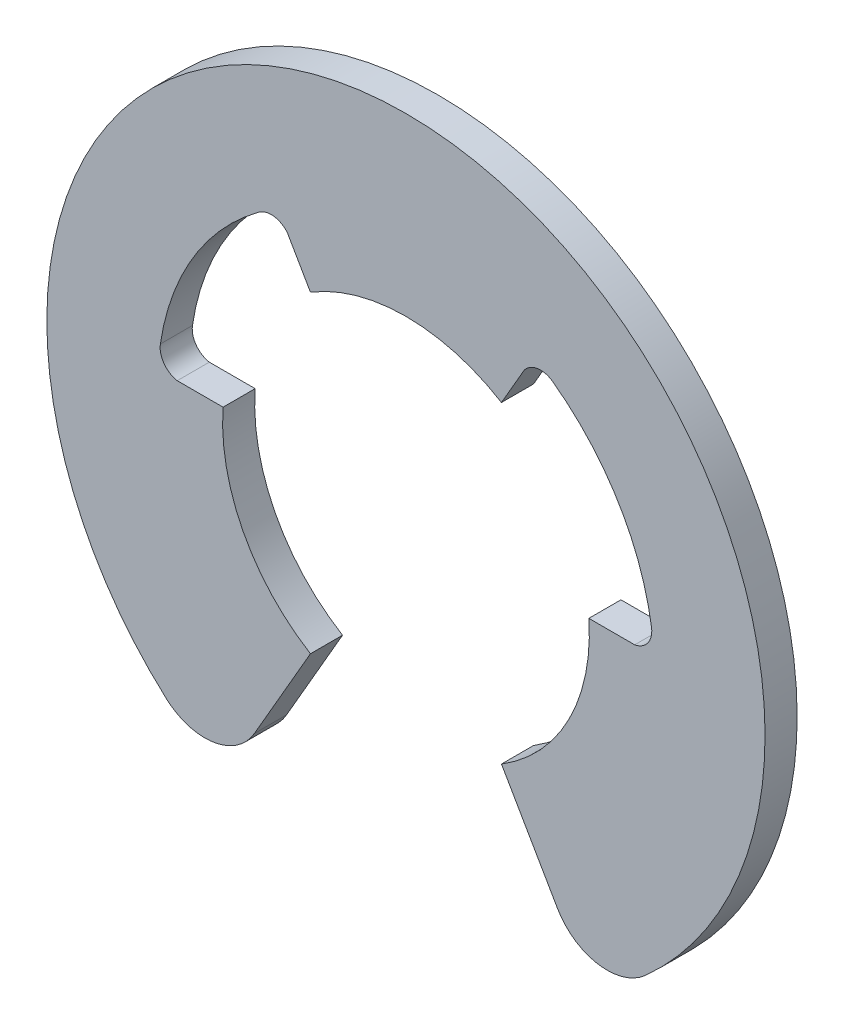
ISO-10303-21;
HEADER;
FILE_DESCRIPTION(('STEP AP214'),'2;1');
FILE_NAME('part.step','',(''),(''),'','','');
FILE_SCHEMA(('AUTOMOTIVE_DESIGN { 1 0 10303 214 1 1 1 1 }'));
ENDSEC;
DATA;
#1=APPLICATION_CONTEXT('core data for automotive mechanical design processes');
#2=APPLICATION_PROTOCOL_DEFINITION('international standard','automotive_design',2000,#1);
#3=PRODUCT_CONTEXT('',#1,'mechanical');
#4=PRODUCT('Part','Part','',(#3));
#5=PRODUCT_RELATED_PRODUCT_CATEGORY('part','',(#4));
#6=PRODUCT_DEFINITION_FORMATION('','',#4);
#7=PRODUCT_DEFINITION_CONTEXT('part definition',#1,'design');
#8=PRODUCT_DEFINITION('design','',#6,#7);
#9=PRODUCT_DEFINITION_SHAPE('','',#8);
#10=(LENGTH_UNIT() NAMED_UNIT(*) SI_UNIT(.MILLI.,.METRE.));
#11=(NAMED_UNIT(*) PLANE_ANGLE_UNIT() SI_UNIT($,.RADIAN.));
#12=(NAMED_UNIT(*) SI_UNIT($,.STERADIAN.) SOLID_ANGLE_UNIT());
#13=UNCERTAINTY_MEASURE_WITH_UNIT(LENGTH_MEASURE(1.E-05),#10,'distance_accuracy_value','');
#14=(GEOMETRIC_REPRESENTATION_CONTEXT(3) GLOBAL_UNCERTAINTY_ASSIGNED_CONTEXT((#13)) GLOBAL_UNIT_ASSIGNED_CONTEXT((#10,
#11,#12)) REPRESENTATION_CONTEXT('',''));
#15=CARTESIAN_POINT('',(0.,0.,0.));
#16=DIRECTION('',(0.,0.,1.));
#17=DIRECTION('',(1.,0.,0.));
#18=AXIS2_PLACEMENT_3D('',#15,#16,#17);
#19=CARTESIAN_POINT('',(0.,0.891268046824813,-0.5334));
#20=DIRECTION('',(0.,0.,1.));
#21=DIRECTION('',(1.,0.,0.));
#22=AXIS2_PLACEMENT_3D('',#19,#20,#21);
#23=PLANE('',#22);
#24=DIRECTION('',(0.5,0.866025403784439,0.));
#25=VECTOR('',#24,1.);
#26=CARTESIAN_POINT('',(3.937,6.52372423249865,-0.5334));
#27=LINE('',#26,#25);
#28=CARTESIAN_POINT('',(3.175,5.20390151713116,-0.5334));
#29=VERTEX_POINT('',#28);
#30=CARTESIAN_POINT('',(3.937,6.52372423249865,-0.5334));
#31=VERTEX_POINT('',#30);
#32=EDGE_CURVE('E150',#29,#31,#27,.T.);
#33=ORIENTED_EDGE('',*,*,#32,.F.);
#34=CARTESIAN_POINT('',(0.,0.,-0.5334));
#35=DIRECTION('',(0.,0.,-1.));
#36=DIRECTION('',(0.,-1.,0.));
#37=AXIS2_PLACEMENT_3D('',#34,#35,#36);
#38=CIRCLE('',#37,6.096);
#39=CARTESIAN_POINT('',(-3.175,5.20390151713116,-0.5334));
#40=VERTEX_POINT('',#39);
#41=EDGE_CURVE('E34',#40,#29,#38,.T.);
#42=ORIENTED_EDGE('',*,*,#41,.F.);
#43=DIRECTION('',(0.5,-0.866025403784439,0.));
#44=VECTOR('',#43,1.);
#45=CARTESIAN_POINT('',(-3.175,5.20390151713116,-0.5334));
#46=LINE('',#45,#44);
#47=CARTESIAN_POINT('',(-3.937,6.52372423249865,-0.5334));
#48=VERTEX_POINT('',#47);
#49=EDGE_CURVE('E164',#48,#40,#46,.T.);
#50=ORIENTED_EDGE('',*,*,#49,.F.);
#51=CARTESIAN_POINT('',(-4.47800833674543,6.10317047054672,-0.5334));
#52=DIRECTION('',(0.,0.,-1.));
#53=DIRECTION('',(0.,-1.,0.));
#54=AXIS2_PLACEMENT_3D('',#51,#52,#53);
#55=CIRCLE('',#54,0.68524118901302);
#56=CARTESIAN_POINT('',(-4.88337339971519,6.65565092526299,-0.5334));
#57=VERTEX_POINT('',#56);
#58=EDGE_CURVE('E168',#57,#48,#55,.T.);
#59=ORIENTED_EDGE('',*,*,#58,.F.);
#60=CARTESIAN_POINT('',(0.,0.,-0.5334));
#61=DIRECTION('',(0.,0.,-1.));
#62=DIRECTION('',(0.,-1.,0.));
#63=AXIS2_PLACEMENT_3D('',#60,#61,#62);
#64=CIRCLE('',#63,8.25500000000001);
#65=CARTESIAN_POINT('',(-8.16449435264891,1.21903936177794,-0.5334));
#66=VERTEX_POINT('',#65);
#67=EDGE_CURVE('E175',#66,#57,#64,.T.);
#68=ORIENTED_EDGE('',*,*,#67,.F.);
#69=CARTESIAN_POINT('',(-7.48676596768232,1.11784784370182,-0.5334));
#70=DIRECTION('',(0.,0.,-1.));
#71=DIRECTION('',(0.,-1.,0.));
#72=AXIS2_PLACEMENT_3D('',#69,#70,#71);
#73=CIRCLE('',#72,0.68524118901302);
#74=CARTESIAN_POINT('',(-7.60390451388889,0.44269301100595,-0.5334));
#75=VERTEX_POINT('',#74);
#76=EDGE_CURVE('E182',#75,#66,#73,.T.);
#77=ORIENTED_EDGE('',*,*,#76,.F.);
#78=DIRECTION('',(-1.,0.,0.));
#79=VECTOR('',#78,1.);
#80=CARTESIAN_POINT('',(-7.60390451388889,0.44269301100595,-0.5334));
#81=LINE('',#80,#79);
#82=CARTESIAN_POINT('',(-6.07990451388889,0.442693011005949,-0.5334));
#83=VERTEX_POINT('',#82);
#84=EDGE_CURVE('E189',#83,#75,#81,.T.);
#85=ORIENTED_EDGE('',*,*,#84,.F.);
#86=CARTESIAN_POINT('',(0.,0.,-0.5334));
#87=DIRECTION('',(0.,0.,-1.));
#88=DIRECTION('',(0.,-1.,0.));
#89=AXIS2_PLACEMENT_3D('',#86,#87,#88);
#90=CIRCLE('',#89,6.096);
#91=CARTESIAN_POINT('',(-3.175,-5.20390151713116,-0.5334));
#92=VERTEX_POINT('',#91);
#93=EDGE_CURVE('E196',#92,#83,#90,.T.);
#94=ORIENTED_EDGE('',*,*,#93,.F.);
#95=DIRECTION('',(0.5,0.866025403784438,0.));
#96=VECTOR('',#95,1.);
#97=CARTESIAN_POINT('',(-3.175,-5.20390151713116,-0.5334));
#98=LINE('',#97,#96);
#99=CARTESIAN_POINT('',(-5.03828134704732,-8.43119947901249,-0.5334));
#100=VERTEX_POINT('',#99);
#101=EDGE_CURVE('E203',#100,#92,#98,.T.);
#102=ORIENTED_EDGE('',*,*,#101,.F.);
#103=CARTESIAN_POINT('',(-6.68805974125667,-7.47869947901249,-0.5334));
#104=DIRECTION('',(0.,0.,1.));
#105=DIRECTION('',(1.,0.,0.));
#106=AXIS2_PLACEMENT_3D('',#103,#104,#105);
#107=CIRCLE('',#106,1.905);
#108=CARTESIAN_POINT('',(-7.95794450225478,-8.89870570920474,-0.5334));
#109=VERTEX_POINT('',#108);
#110=EDGE_CURVE('E210',#109,#100,#107,.T.);
#111=ORIENTED_EDGE('',*,*,#110,.F.);
#112=CARTESIAN_POINT('',(0.,0.,-0.5334));
#113=DIRECTION('',(0.,0.,1.));
#114=DIRECTION('',(1.,0.,0.));
#115=AXIS2_PLACEMENT_3D('',#112,#113,#114);
#116=CIRCLE('',#115,11.938);
#117=CARTESIAN_POINT('',(7.95794450225478,-8.89870570920474,-0.5334));
#118=VERTEX_POINT('',#117);
#119=EDGE_CURVE('E217',#118,#109,#116,.T.);
#120=ORIENTED_EDGE('',*,*,#119,.F.);
#121=CARTESIAN_POINT('',(6.68805974125667,-7.47869947901249,-0.5334));
#122=DIRECTION('',(0.,0.,1.));
#123=DIRECTION('',(1.,0.,0.));
#124=AXIS2_PLACEMENT_3D('',#121,#122,#123);
#125=CIRCLE('',#124,1.905);
#126=CARTESIAN_POINT('',(5.03828134704732,-8.43119947901249,-0.5334));
#127=VERTEX_POINT('',#126);
#128=EDGE_CURVE('E224',#127,#118,#125,.T.);
#129=ORIENTED_EDGE('',*,*,#128,.F.);
#130=DIRECTION('',(0.5,-0.866025403784439,0.));
#131=VECTOR('',#130,1.);
#132=CARTESIAN_POINT('',(5.03828134704732,-8.43119947901249,-0.5334));
#133=LINE('',#132,#131);
#134=CARTESIAN_POINT('',(3.175,-5.20390151713116,-0.5334));
#135=VERTEX_POINT('',#134);
#136=EDGE_CURVE('E231',#135,#127,#133,.T.);
#137=ORIENTED_EDGE('',*,*,#136,.F.);
#138=CARTESIAN_POINT('',(0.,0.,-0.5334));
#139=DIRECTION('',(0.,0.,-1.));
#140=DIRECTION('',(0.,-1.,0.));
#141=AXIS2_PLACEMENT_3D('',#138,#139,#140);
#142=CIRCLE('',#141,6.096);
#143=CARTESIAN_POINT('',(6.07990451388889,0.442693011005951,-0.5334));
#144=VERTEX_POINT('',#143);
#145=EDGE_CURVE('E238',#144,#135,#142,.T.);
#146=ORIENTED_EDGE('',*,*,#145,.F.);
#147=DIRECTION('',(-1.,0.,0.));
#148=VECTOR('',#147,1.);
#149=CARTESIAN_POINT('',(6.07990451388889,0.442693011005951,-0.5334));
#150=LINE('',#149,#148);
#151=CARTESIAN_POINT('',(7.60390451388889,0.442693011005948,-0.5334));
#152=VERTEX_POINT('',#151);
#153=EDGE_CURVE('E245',#152,#144,#150,.T.);
#154=ORIENTED_EDGE('',*,*,#153,.F.);
#155=CARTESIAN_POINT('',(7.48676596768232,1.11784784370182,-0.5334));
#156=DIRECTION('',(0.,0.,-1.));
#157=DIRECTION('',(0.,-1.,0.));
#158=AXIS2_PLACEMENT_3D('',#155,#156,#157);
#159=CIRCLE('',#158,0.685241189013017);
#160=CARTESIAN_POINT('',(8.16449435264892,1.21903936177794,-0.5334));
#161=VERTEX_POINT('',#160);
#162=EDGE_CURVE('E252',#161,#152,#159,.T.);
#163=ORIENTED_EDGE('',*,*,#162,.F.);
#164=CARTESIAN_POINT('',(0.,0.,-0.5334));
#165=DIRECTION('',(0.,0.,-1.));
#166=DIRECTION('',(0.,-1.,0.));
#167=AXIS2_PLACEMENT_3D('',#164,#165,#166);
#168=CIRCLE('',#167,8.255);
#169=CARTESIAN_POINT('',(4.88337339971519,6.65565092526299,-0.5334));
#170=VERTEX_POINT('',#169);
#171=EDGE_CURVE('E259',#170,#161,#168,.T.);
#172=ORIENTED_EDGE('',*,*,#171,.F.);
#173=CARTESIAN_POINT('',(4.47800833674543,6.10317047054672,-0.5334));
#174=DIRECTION('',(0.,0.,-1.));
#175=DIRECTION('',(0.,-1.,0.));
#176=AXIS2_PLACEMENT_3D('',#173,#174,#175);
#177=CIRCLE('',#176,0.685241189013017);
#178=EDGE_CURVE('E149',#31,#170,#177,.T.);
#179=ORIENTED_EDGE('',*,*,#178,.F.);
#180=EDGE_LOOP('',(#33,#42,#50,#59,#68,#77,#85,#94,#102,#111,#120,#129,#137,#146,#154,#163,#172,#179));
#181=FACE_BOUND('',#180,.T.);
#182=ADVANCED_FACE('F15',(#181),#23,.F.);
#183=CARTESIAN_POINT('',(-3.175,5.20390151713116,0.));
#184=DIRECTION('',(-0.866025403784439,-0.5,0.));
#185=DIRECTION('',(0.5,-0.866025403784439,0.));
#186=AXIS2_PLACEMENT_3D('',#183,#184,#185);
#187=PLANE('',#186);
#188=DIRECTION('',(-0.5,0.866025403784439,0.));
#189=VECTOR('',#188,1.);
#190=CARTESIAN_POINT('',(-3.175,5.20390151713116,0.5334));
#191=LINE('',#190,#189);
#192=CARTESIAN_POINT('',(-3.175,5.20390151713116,0.5334));
#193=VERTEX_POINT('',#192);
#194=CARTESIAN_POINT('',(-3.937,6.52372423249865,0.5334));
#195=VERTEX_POINT('',#194);
#196=EDGE_CURVE('E9',#193,#195,#191,.T.);
#197=ORIENTED_EDGE('',*,*,#196,.T.);
#198=DIRECTION('',(0.,0.,-1.));
#199=VECTOR('',#198,1.);
#200=CARTESIAN_POINT('',(-3.937,6.52372423249865,0.));
#201=LINE('',#200,#199);
#202=EDGE_CURVE('E25',#195,#48,#201,.T.);
#203=ORIENTED_EDGE('',*,*,#202,.T.);
#204=ORIENTED_EDGE('',*,*,#49,.T.);
#205=DIRECTION('',(0.,0.,-1.));
#206=VECTOR('',#205,1.);
#207=CARTESIAN_POINT('',(-3.175,5.20390151713116,0.));
#208=LINE('',#207,#206);
#209=EDGE_CURVE('E155',#193,#40,#208,.T.);
#210=ORIENTED_EDGE('',*,*,#209,.F.);
#211=EDGE_LOOP('',(#197,#203,#204,#210));
#212=FACE_BOUND('',#211,.T.);
#213=ADVANCED_FACE('F285',(#212),#187,.T.);
#214=CARTESIAN_POINT('',(-4.47800833674543,6.10317047054672,0.));
#215=DIRECTION('',(0.,0.,1.));
#216=DIRECTION('',(1.,0.,0.));
#217=AXIS2_PLACEMENT_3D('',#214,#215,#216);
#218=CYLINDRICAL_SURFACE('',#217,0.68524118901302);
#219=CARTESIAN_POINT('',(-4.47800833674543,6.10317047054672,0.5334));
#220=DIRECTION('',(0.,0.,1.));
#221=DIRECTION('',(1.,0.,0.));
#222=AXIS2_PLACEMENT_3D('',#219,#220,#221);
#223=CIRCLE('',#222,0.68524118901302);
#224=CARTESIAN_POINT('',(-4.88337339971519,6.65565092526299,0.5334));
#225=VERTEX_POINT('',#224);
#226=EDGE_CURVE('E161',#195,#225,#223,.T.);
#227=ORIENTED_EDGE('',*,*,#226,.T.);
#228=DIRECTION('',(0.,0.,-1.));
#229=VECTOR('',#228,1.);
#230=CARTESIAN_POINT('',(-4.88337339971519,6.65565092526299,0.));
#231=LINE('',#230,#229);
#232=EDGE_CURVE('E165',#225,#57,#231,.T.);
#233=ORIENTED_EDGE('',*,*,#232,.T.);
#234=ORIENTED_EDGE('',*,*,#58,.T.);
#235=ORIENTED_EDGE('',*,*,#202,.F.);
#236=EDGE_LOOP('',(#227,#233,#234,#235));
#237=FACE_BOUND('',#236,.T.);
#238=ADVANCED_FACE('F287',(#237),#218,.F.);
#239=CARTESIAN_POINT('',(0.,0.,0.));
#240=DIRECTION('',(0.,0.,1.));
#241=DIRECTION('',(1.,0.,0.));
#242=AXIS2_PLACEMENT_3D('',#239,#240,#241);
#243=CYLINDRICAL_SURFACE('',#242,8.25500000000001);
#244=CARTESIAN_POINT('',(0.,0.,0.5334));
#245=DIRECTION('',(0.,0.,1.));
#246=DIRECTION('',(1.,0.,0.));
#247=AXIS2_PLACEMENT_3D('',#244,#245,#246);
#248=CIRCLE('',#247,8.25500000000001);
#249=CARTESIAN_POINT('',(-8.16449435264891,1.21903936177794,0.5334));
#250=VERTEX_POINT('',#249);
#251=EDGE_CURVE('E169',#225,#250,#248,.T.);
#252=ORIENTED_EDGE('',*,*,#251,.T.);
#253=DIRECTION('',(0.,0.,-1.));
#254=VECTOR('',#253,1.);
#255=CARTESIAN_POINT('',(-8.16449435264891,1.21903936177794,0.));
#256=LINE('',#255,#254);
#257=EDGE_CURVE('E172',#250,#66,#256,.T.);
#258=ORIENTED_EDGE('',*,*,#257,.T.);
#259=ORIENTED_EDGE('',*,*,#67,.T.);
#260=ORIENTED_EDGE('',*,*,#232,.F.);
#261=EDGE_LOOP('',(#252,#258,#259,#260));
#262=FACE_BOUND('',#261,.T.);
#263=ADVANCED_FACE('F341',(#262),#243,.F.);
#264=CARTESIAN_POINT('',(-7.48676596768232,1.11784784370182,0.));
#265=DIRECTION('',(0.,0.,1.));
#266=DIRECTION('',(1.,0.,0.));
#267=AXIS2_PLACEMENT_3D('',#264,#265,#266);
#268=CYLINDRICAL_SURFACE('',#267,0.68524118901302);
#269=CARTESIAN_POINT('',(-7.48676596768232,1.11784784370182,0.5334));
#270=DIRECTION('',(0.,0.,1.));
#271=DIRECTION('',(1.,0.,0.));
#272=AXIS2_PLACEMENT_3D('',#269,#270,#271);
#273=CIRCLE('',#272,0.68524118901302);
#274=CARTESIAN_POINT('',(-7.60390451388889,0.44269301100595,0.5334));
#275=VERTEX_POINT('',#274);
#276=EDGE_CURVE('E176',#250,#275,#273,.T.);
#277=ORIENTED_EDGE('',*,*,#276,.T.);
#278=DIRECTION('',(0.,0.,-1.));
#279=VECTOR('',#278,1.);
#280=CARTESIAN_POINT('',(-7.60390451388889,0.44269301100595,0.));
#281=LINE('',#280,#279);
#282=EDGE_CURVE('E179',#275,#75,#281,.T.);
#283=ORIENTED_EDGE('',*,*,#282,.T.);
#284=ORIENTED_EDGE('',*,*,#76,.T.);
#285=ORIENTED_EDGE('',*,*,#257,.F.);
#286=EDGE_LOOP('',(#277,#283,#284,#285));
#287=FACE_BOUND('',#286,.T.);
#288=ADVANCED_FACE('F339',(#287),#268,.F.);
#289=CARTESIAN_POINT('',(-7.60390451388889,0.44269301100595,0.));
#290=DIRECTION('',(0.,1.,0.));
#291=DIRECTION('',(-1.,0.,0.));
#292=AXIS2_PLACEMENT_3D('',#289,#290,#291);
#293=PLANE('',#292);
#294=DIRECTION('',(1.,0.,0.));
#295=VECTOR('',#294,1.);
#296=CARTESIAN_POINT('',(-7.60390451388889,0.44269301100595,0.5334));
#297=LINE('',#296,#295);
#298=CARTESIAN_POINT('',(-6.07990451388889,0.442693011005949,0.5334));
#299=VERTEX_POINT('',#298);
#300=EDGE_CURVE('E183',#275,#299,#297,.T.);
#301=ORIENTED_EDGE('',*,*,#300,.T.);
#302=DIRECTION('',(0.,0.,-1.));
#303=VECTOR('',#302,1.);
#304=CARTESIAN_POINT('',(-6.07990451388889,0.442693011005949,0.));
#305=LINE('',#304,#303);
#306=EDGE_CURVE('E186',#299,#83,#305,.T.);
#307=ORIENTED_EDGE('',*,*,#306,.T.);
#308=ORIENTED_EDGE('',*,*,#84,.T.);
#309=ORIENTED_EDGE('',*,*,#282,.F.);
#310=EDGE_LOOP('',(#301,#307,#308,#309));
#311=FACE_BOUND('',#310,.T.);
#312=ADVANCED_FACE('F335',(#311),#293,.T.);
#313=CARTESIAN_POINT('',(0.,0.,0.));
#314=DIRECTION('',(0.,0.,1.));
#315=DIRECTION('',(1.,0.,0.));
#316=AXIS2_PLACEMENT_3D('',#313,#314,#315);
#317=CYLINDRICAL_SURFACE('',#316,6.096);
#318=CARTESIAN_POINT('',(0.,0.,0.5334));
#319=DIRECTION('',(0.,0.,1.));
#320=DIRECTION('',(1.,0.,0.));
#321=AXIS2_PLACEMENT_3D('',#318,#319,#320);
#322=CIRCLE('',#321,6.096);
#323=CARTESIAN_POINT('',(-3.175,-5.20390151713116,0.5334));
#324=VERTEX_POINT('',#323);
#325=EDGE_CURVE('E190',#299,#324,#322,.T.);
#326=ORIENTED_EDGE('',*,*,#325,.T.);
#327=DIRECTION('',(0.,0.,-1.));
#328=VECTOR('',#327,1.);
#329=CARTESIAN_POINT('',(-3.175,-5.20390151713116,0.));
#330=LINE('',#329,#328);
#331=EDGE_CURVE('E193',#324,#92,#330,.T.);
#332=ORIENTED_EDGE('',*,*,#331,.T.);
#333=ORIENTED_EDGE('',*,*,#93,.T.);
#334=ORIENTED_EDGE('',*,*,#306,.F.);
#335=EDGE_LOOP('',(#326,#332,#333,#334));
#336=FACE_BOUND('',#335,.T.);
#337=ADVANCED_FACE('F331',(#336),#317,.F.);
#338=CARTESIAN_POINT('',(-3.175,-5.20390151713116,0.));
#339=DIRECTION('',(0.866025403784438,-0.5,0.));
#340=DIRECTION('',(0.5,0.866025403784438,0.));
#341=AXIS2_PLACEMENT_3D('',#338,#339,#340);
#342=PLANE('',#341);
#343=DIRECTION('',(-0.5,-0.866025403784438,0.));
#344=VECTOR('',#343,1.);
#345=CARTESIAN_POINT('',(-3.175,-5.20390151713116,0.5334));
#346=LINE('',#345,#344);
#347=CARTESIAN_POINT('',(-5.03828134704732,-8.43119947901249,0.5334));
#348=VERTEX_POINT('',#347);
#349=EDGE_CURVE('E197',#324,#348,#346,.T.);
#350=ORIENTED_EDGE('',*,*,#349,.T.);
#351=DIRECTION('',(0.,0.,-1.));
#352=VECTOR('',#351,1.);
#353=CARTESIAN_POINT('',(-5.03828134704732,-8.43119947901249,0.));
#354=LINE('',#353,#352);
#355=EDGE_CURVE('E200',#348,#100,#354,.T.);
#356=ORIENTED_EDGE('',*,*,#355,.T.);
#357=ORIENTED_EDGE('',*,*,#101,.T.);
#358=ORIENTED_EDGE('',*,*,#331,.F.);
#359=EDGE_LOOP('',(#350,#356,#357,#358));
#360=FACE_BOUND('',#359,.T.);
#361=ADVANCED_FACE('F328',(#360),#342,.T.);
#362=CARTESIAN_POINT('',(-6.68805974125667,-7.47869947901249,0.));
#363=DIRECTION('',(0.,0.,1.));
#364=DIRECTION('',(1.,0.,0.));
#365=AXIS2_PLACEMENT_3D('',#362,#363,#364);
#366=CYLINDRICAL_SURFACE('',#365,1.905);
#367=CARTESIAN_POINT('',(-6.68805974125667,-7.47869947901249,0.5334));
#368=DIRECTION('',(0.,0.,-1.));
#369=DIRECTION('',(0.,-1.,0.));
#370=AXIS2_PLACEMENT_3D('',#367,#368,#369);
#371=CIRCLE('',#370,1.905);
#372=CARTESIAN_POINT('',(-7.95794450225478,-8.89870570920474,0.5334));
#373=VERTEX_POINT('',#372);
#374=EDGE_CURVE('E204',#348,#373,#371,.T.);
#375=ORIENTED_EDGE('',*,*,#374,.T.);
#376=DIRECTION('',(0.,0.,-1.));
#377=VECTOR('',#376,1.);
#378=CARTESIAN_POINT('',(-7.95794450225478,-8.89870570920474,0.));
#379=LINE('',#378,#377);
#380=EDGE_CURVE('E207',#373,#109,#379,.T.);
#381=ORIENTED_EDGE('',*,*,#380,.T.);
#382=ORIENTED_EDGE('',*,*,#110,.T.);
#383=ORIENTED_EDGE('',*,*,#355,.F.);
#384=EDGE_LOOP('',(#375,#381,#382,#383));
#385=FACE_BOUND('',#384,.T.);
#386=ADVANCED_FACE('F324',(#385),#366,.T.);
#387=CARTESIAN_POINT('',(0.,0.,0.));
#388=DIRECTION('',(0.,0.,1.));
#389=DIRECTION('',(1.,0.,0.));
#390=AXIS2_PLACEMENT_3D('',#387,#388,#389);
#391=CYLINDRICAL_SURFACE('',#390,11.938);
#392=CARTESIAN_POINT('',(0.,0.,0.5334));
#393=DIRECTION('',(0.,0.,-1.));
#394=DIRECTION('',(0.,-1.,0.));
#395=AXIS2_PLACEMENT_3D('',#392,#393,#394);
#396=CIRCLE('',#395,11.938);
#397=CARTESIAN_POINT('',(7.95794450225478,-8.89870570920474,0.5334));
#398=VERTEX_POINT('',#397);
#399=EDGE_CURVE('E211',#373,#398,#396,.T.);
#400=ORIENTED_EDGE('',*,*,#399,.T.);
#401=DIRECTION('',(0.,0.,-1.));
#402=VECTOR('',#401,1.);
#403=CARTESIAN_POINT('',(7.95794450225478,-8.89870570920474,0.));
#404=LINE('',#403,#402);
#405=EDGE_CURVE('E214',#398,#118,#404,.T.);
#406=ORIENTED_EDGE('',*,*,#405,.T.);
#407=ORIENTED_EDGE('',*,*,#119,.T.);
#408=ORIENTED_EDGE('',*,*,#380,.F.);
#409=EDGE_LOOP('',(#400,#406,#407,#408));
#410=FACE_BOUND('',#409,.T.);
#411=ADVANCED_FACE('F319',(#410),#391,.T.);
#412=CARTESIAN_POINT('',(6.68805974125667,-7.47869947901249,0.));
#413=DIRECTION('',(0.,0.,1.));
#414=DIRECTION('',(1.,0.,0.));
#415=AXIS2_PLACEMENT_3D('',#412,#413,#414);
#416=CYLINDRICAL_SURFACE('',#415,1.905);
#417=CARTESIAN_POINT('',(6.68805974125667,-7.47869947901249,0.5334));
#418=DIRECTION('',(0.,0.,-1.));
#419=DIRECTION('',(0.,-1.,0.));
#420=AXIS2_PLACEMENT_3D('',#417,#418,#419);
#421=CIRCLE('',#420,1.905);
#422=CARTESIAN_POINT('',(5.03828134704732,-8.43119947901249,0.5334));
#423=VERTEX_POINT('',#422);
#424=EDGE_CURVE('E218',#398,#423,#421,.T.);
#425=ORIENTED_EDGE('',*,*,#424,.T.);
#426=DIRECTION('',(0.,0.,-1.));
#427=VECTOR('',#426,1.);
#428=CARTESIAN_POINT('',(5.03828134704732,-8.43119947901249,0.));
#429=LINE('',#428,#427);
#430=EDGE_CURVE('E221',#423,#127,#429,.T.);
#431=ORIENTED_EDGE('',*,*,#430,.T.);
#432=ORIENTED_EDGE('',*,*,#128,.T.);
#433=ORIENTED_EDGE('',*,*,#405,.F.);
#434=EDGE_LOOP('',(#425,#431,#432,#433));
#435=FACE_BOUND('',#434,.T.);
#436=ADVANCED_FACE('F316',(#435),#416,.T.);
#437=CARTESIAN_POINT('',(5.03828134704732,-8.43119947901249,0.));
#438=DIRECTION('',(-0.866025403784439,-0.5,0.));
#439=DIRECTION('',(0.5,-0.866025403784439,0.));
#440=AXIS2_PLACEMENT_3D('',#437,#438,#439);
#441=PLANE('',#440);
#442=DIRECTION('',(-0.5,0.866025403784439,0.));
#443=VECTOR('',#442,1.);
#444=CARTESIAN_POINT('',(5.03828134704732,-8.43119947901249,0.5334));
#445=LINE('',#444,#443);
#446=CARTESIAN_POINT('',(3.175,-5.20390151713116,0.5334));
#447=VERTEX_POINT('',#446);
#448=EDGE_CURVE('E225',#423,#447,#445,.T.);
#449=ORIENTED_EDGE('',*,*,#448,.T.);
#450=DIRECTION('',(0.,0.,-1.));
#451=VECTOR('',#450,1.);
#452=CARTESIAN_POINT('',(3.175,-5.20390151713116,0.));
#453=LINE('',#452,#451);
#454=EDGE_CURVE('E228',#447,#135,#453,.T.);
#455=ORIENTED_EDGE('',*,*,#454,.T.);
#456=ORIENTED_EDGE('',*,*,#136,.T.);
#457=ORIENTED_EDGE('',*,*,#430,.F.);
#458=EDGE_LOOP('',(#449,#455,#456,#457));
#459=FACE_BOUND('',#458,.T.);
#460=ADVANCED_FACE('F312',(#459),#441,.T.);
#461=CARTESIAN_POINT('',(0.,0.,0.));
#462=DIRECTION('',(0.,0.,1.));
#463=DIRECTION('',(1.,0.,0.));
#464=AXIS2_PLACEMENT_3D('',#461,#462,#463);
#465=CYLINDRICAL_SURFACE('',#464,6.096);
#466=CARTESIAN_POINT('',(0.,0.,0.5334));
#467=DIRECTION('',(0.,0.,1.));
#468=DIRECTION('',(1.,0.,0.));
#469=AXIS2_PLACEMENT_3D('',#466,#467,#468);
#470=CIRCLE('',#469,6.096);
#471=CARTESIAN_POINT('',(6.07990451388889,0.442693011005951,0.5334));
#472=VERTEX_POINT('',#471);
#473=EDGE_CURVE('E232',#447,#472,#470,.T.);
#474=ORIENTED_EDGE('',*,*,#473,.T.);
#475=DIRECTION('',(0.,0.,-1.));
#476=VECTOR('',#475,1.);
#477=CARTESIAN_POINT('',(6.07990451388889,0.442693011005951,0.));
#478=LINE('',#477,#476);
#479=EDGE_CURVE('E235',#472,#144,#478,.T.);
#480=ORIENTED_EDGE('',*,*,#479,.T.);
#481=ORIENTED_EDGE('',*,*,#145,.T.);
#482=ORIENTED_EDGE('',*,*,#454,.F.);
#483=EDGE_LOOP('',(#474,#480,#481,#482));
#484=FACE_BOUND('',#483,.T.);
#485=ADVANCED_FACE('F307',(#484),#465,.F.);
#486=CARTESIAN_POINT('',(6.07990451388889,0.442693011005951,0.));
#487=DIRECTION('',(0.,1.,0.));
#488=DIRECTION('',(-1.,0.,0.));
#489=AXIS2_PLACEMENT_3D('',#486,#487,#488);
#490=PLANE('',#489);
#491=DIRECTION('',(1.,0.,0.));
#492=VECTOR('',#491,1.);
#493=CARTESIAN_POINT('',(6.07990451388889,0.442693011005951,0.5334));
#494=LINE('',#493,#492);
#495=CARTESIAN_POINT('',(7.60390451388889,0.442693011005948,0.5334));
#496=VERTEX_POINT('',#495);
#497=EDGE_CURVE('E239',#472,#496,#494,.T.);
#498=ORIENTED_EDGE('',*,*,#497,.T.);
#499=DIRECTION('',(0.,0.,-1.));
#500=VECTOR('',#499,1.);
#501=CARTESIAN_POINT('',(7.60390451388889,0.442693011005948,0.));
#502=LINE('',#501,#500);
#503=EDGE_CURVE('E242',#496,#152,#502,.T.);
#504=ORIENTED_EDGE('',*,*,#503,.T.);
#505=ORIENTED_EDGE('',*,*,#153,.T.);
#506=ORIENTED_EDGE('',*,*,#479,.F.);
#507=EDGE_LOOP('',(#498,#504,#505,#506));
#508=FACE_BOUND('',#507,.T.);
#509=ADVANCED_FACE('F304',(#508),#490,.T.);
#510=CARTESIAN_POINT('',(7.48676596768232,1.11784784370182,0.));
#511=DIRECTION('',(0.,0.,1.));
#512=DIRECTION('',(1.,0.,0.));
#513=AXIS2_PLACEMENT_3D('',#510,#511,#512);
#514=CYLINDRICAL_SURFACE('',#513,0.685241189013017);
#515=CARTESIAN_POINT('',(7.48676596768232,1.11784784370182,0.5334));
#516=DIRECTION('',(0.,0.,1.));
#517=DIRECTION('',(1.,0.,0.));
#518=AXIS2_PLACEMENT_3D('',#515,#516,#517);
#519=CIRCLE('',#518,0.685241189013017);
#520=CARTESIAN_POINT('',(8.16449435264892,1.21903936177794,0.5334));
#521=VERTEX_POINT('',#520);
#522=EDGE_CURVE('E246',#496,#521,#519,.T.);
#523=ORIENTED_EDGE('',*,*,#522,.T.);
#524=DIRECTION('',(0.,0.,-1.));
#525=VECTOR('',#524,1.);
#526=CARTESIAN_POINT('',(8.16449435264892,1.21903936177794,0.));
#527=LINE('',#526,#525);
#528=EDGE_CURVE('E249',#521,#161,#527,.T.);
#529=ORIENTED_EDGE('',*,*,#528,.T.);
#530=ORIENTED_EDGE('',*,*,#162,.T.);
#531=ORIENTED_EDGE('',*,*,#503,.F.);
#532=EDGE_LOOP('',(#523,#529,#530,#531));
#533=FACE_BOUND('',#532,.T.);
#534=ADVANCED_FACE('F302',(#533),#514,.F.);
#535=CARTESIAN_POINT('',(0.,0.,0.));
#536=DIRECTION('',(0.,0.,1.));
#537=DIRECTION('',(1.,0.,0.));
#538=AXIS2_PLACEMENT_3D('',#535,#536,#537);
#539=CYLINDRICAL_SURFACE('',#538,8.255);
#540=CARTESIAN_POINT('',(0.,0.,0.5334));
#541=DIRECTION('',(0.,0.,1.));
#542=DIRECTION('',(1.,0.,0.));
#543=AXIS2_PLACEMENT_3D('',#540,#541,#542);
#544=CIRCLE('',#543,8.255);
#545=CARTESIAN_POINT('',(4.88337339971519,6.65565092526299,0.5334));
#546=VERTEX_POINT('',#545);
#547=EDGE_CURVE('E253',#521,#546,#544,.T.);
#548=ORIENTED_EDGE('',*,*,#547,.T.);
#549=DIRECTION('',(0.,0.,-1.));
#550=VECTOR('',#549,1.);
#551=CARTESIAN_POINT('',(4.88337339971519,6.65565092526299,0.));
#552=LINE('',#551,#550);
#553=EDGE_CURVE('E256',#546,#170,#552,.T.);
#554=ORIENTED_EDGE('',*,*,#553,.T.);
#555=ORIENTED_EDGE('',*,*,#171,.T.);
#556=ORIENTED_EDGE('',*,*,#528,.F.);
#557=EDGE_LOOP('',(#548,#554,#555,#556));
#558=FACE_BOUND('',#557,.T.);
#559=ADVANCED_FACE('F295',(#558),#539,.F.);
#560=CARTESIAN_POINT('',(4.47800833674543,6.10317047054672,0.));
#561=DIRECTION('',(0.,0.,1.));
#562=DIRECTION('',(1.,0.,0.));
#563=AXIS2_PLACEMENT_3D('',#560,#561,#562);
#564=CYLINDRICAL_SURFACE('',#563,0.685241189013017);
#565=CARTESIAN_POINT('',(4.47800833674543,6.10317047054672,0.5334));
#566=DIRECTION('',(0.,0.,1.));
#567=DIRECTION('',(1.,0.,0.));
#568=AXIS2_PLACEMENT_3D('',#565,#566,#567);
#569=CIRCLE('',#568,0.685241189013017);
#570=CARTESIAN_POINT('',(3.937,6.52372423249865,0.5334));
#571=VERTEX_POINT('',#570);
#572=EDGE_CURVE('E260',#546,#571,#569,.T.);
#573=ORIENTED_EDGE('',*,*,#572,.T.);
#574=DIRECTION('',(0.,0.,-1.));
#575=VECTOR('',#574,1.);
#576=CARTESIAN_POINT('',(3.937,6.52372423249865,0.));
#577=LINE('',#576,#575);
#578=EDGE_CURVE('E138',#571,#31,#577,.T.);
#579=ORIENTED_EDGE('',*,*,#578,.T.);
#580=ORIENTED_EDGE('',*,*,#178,.T.);
#581=ORIENTED_EDGE('',*,*,#553,.F.);
#582=EDGE_LOOP('',(#573,#579,#580,#581));
#583=FACE_BOUND('',#582,.T.);
#584=ADVANCED_FACE('F297',(#583),#564,.F.);
#585=CARTESIAN_POINT('',(3.937,6.52372423249865,0.));
#586=DIRECTION('',(0.866025403784439,-0.5,0.));
#587=DIRECTION('',(0.5,0.866025403784439,0.));
#588=AXIS2_PLACEMENT_3D('',#585,#586,#587);
#589=PLANE('',#588);
#590=DIRECTION('',(-0.5,-0.866025403784439,0.));
#591=VECTOR('',#590,1.);
#592=CARTESIAN_POINT('',(3.937,6.52372423249865,0.5334));
#593=LINE('',#592,#591);
#594=CARTESIAN_POINT('',(3.175,5.20390151713116,0.5334));
#595=VERTEX_POINT('',#594);
#596=EDGE_CURVE('E145',#571,#595,#593,.T.);
#597=ORIENTED_EDGE('',*,*,#596,.T.);
#598=DIRECTION('',(0.,0.,1.));
#599=VECTOR('',#598,1.);
#600=CARTESIAN_POINT('',(3.175,5.20390151713116,0.));
#601=LINE('',#600,#599);
#602=EDGE_CURVE('E142',#29,#595,#601,.T.);
#603=ORIENTED_EDGE('',*,*,#602,.F.);
#604=ORIENTED_EDGE('',*,*,#32,.T.);
#605=ORIENTED_EDGE('',*,*,#578,.F.);
#606=EDGE_LOOP('',(#597,#603,#604,#605));
#607=FACE_BOUND('',#606,.T.);
#608=ADVANCED_FACE('F146',(#607),#589,.T.);
#609=CARTESIAN_POINT('',(0.,0.,0.));
#610=DIRECTION('',(0.,0.,1.));
#611=DIRECTION('',(1.,0.,0.));
#612=AXIS2_PLACEMENT_3D('',#609,#610,#611);
#613=CYLINDRICAL_SURFACE('',#612,6.096);
#614=CARTESIAN_POINT('',(0.,0.,0.5334));
#615=DIRECTION('',(0.,0.,1.));
#616=DIRECTION('',(1.,0.,0.));
#617=AXIS2_PLACEMENT_3D('',#614,#615,#616);
#618=CIRCLE('',#617,6.096);
#619=EDGE_CURVE('E19',#595,#193,#618,.T.);
#620=ORIENTED_EDGE('',*,*,#619,.T.);
#621=ORIENTED_EDGE('',*,*,#209,.T.);
#622=ORIENTED_EDGE('',*,*,#41,.T.);
#623=ORIENTED_EDGE('',*,*,#602,.T.);
#624=EDGE_LOOP('',(#620,#621,#622,#623));
#625=FACE_BOUND('',#624,.T.);
#626=ADVANCED_FACE('F17',(#625),#613,.F.);
#627=CARTESIAN_POINT('',(0.,0.891268046824813,0.5334));
#628=DIRECTION('',(0.,0.,1.));
#629=DIRECTION('',(1.,0.,0.));
#630=AXIS2_PLACEMENT_3D('',#627,#628,#629);
#631=PLANE('',#630);
#632=ORIENTED_EDGE('',*,*,#196,.F.);
#633=ORIENTED_EDGE('',*,*,#619,.F.);
#634=ORIENTED_EDGE('',*,*,#596,.F.);
#635=ORIENTED_EDGE('',*,*,#572,.F.);
#636=ORIENTED_EDGE('',*,*,#547,.F.);
#637=ORIENTED_EDGE('',*,*,#522,.F.);
#638=ORIENTED_EDGE('',*,*,#497,.F.);
#639=ORIENTED_EDGE('',*,*,#473,.F.);
#640=ORIENTED_EDGE('',*,*,#448,.F.);
#641=ORIENTED_EDGE('',*,*,#424,.F.);
#642=ORIENTED_EDGE('',*,*,#399,.F.);
#643=ORIENTED_EDGE('',*,*,#374,.F.);
#644=ORIENTED_EDGE('',*,*,#349,.F.);
#645=ORIENTED_EDGE('',*,*,#325,.F.);
#646=ORIENTED_EDGE('',*,*,#300,.F.);
#647=ORIENTED_EDGE('',*,*,#276,.F.);
#648=ORIENTED_EDGE('',*,*,#251,.F.);
#649=ORIENTED_EDGE('',*,*,#226,.F.);
#650=EDGE_LOOP('',(#632,#633,#634,#635,#636,#637,#638,#639,#640,#641,#642,#643,#644,#645,#646,
#647,#648,#649));
#651=FACE_BOUND('',#650,.T.);
#652=ADVANCED_FACE('F153',(#651),#631,.T.);
#653=CLOSED_SHELL('',(#182,#213,#238,#263,#288,#312,#337,#361,#386,#411,#436,#460,#485,#509,
#534,#559,#584,#608,#626,#652));
#654=MANIFOLD_SOLID_BREP('B1',#653);
#655=ADVANCED_BREP_SHAPE_REPRESENTATION('',(#18,#654),#14);
#656=SHAPE_DEFINITION_REPRESENTATION(#9,#655);
ENDSEC;
END-ISO-10303-21;
